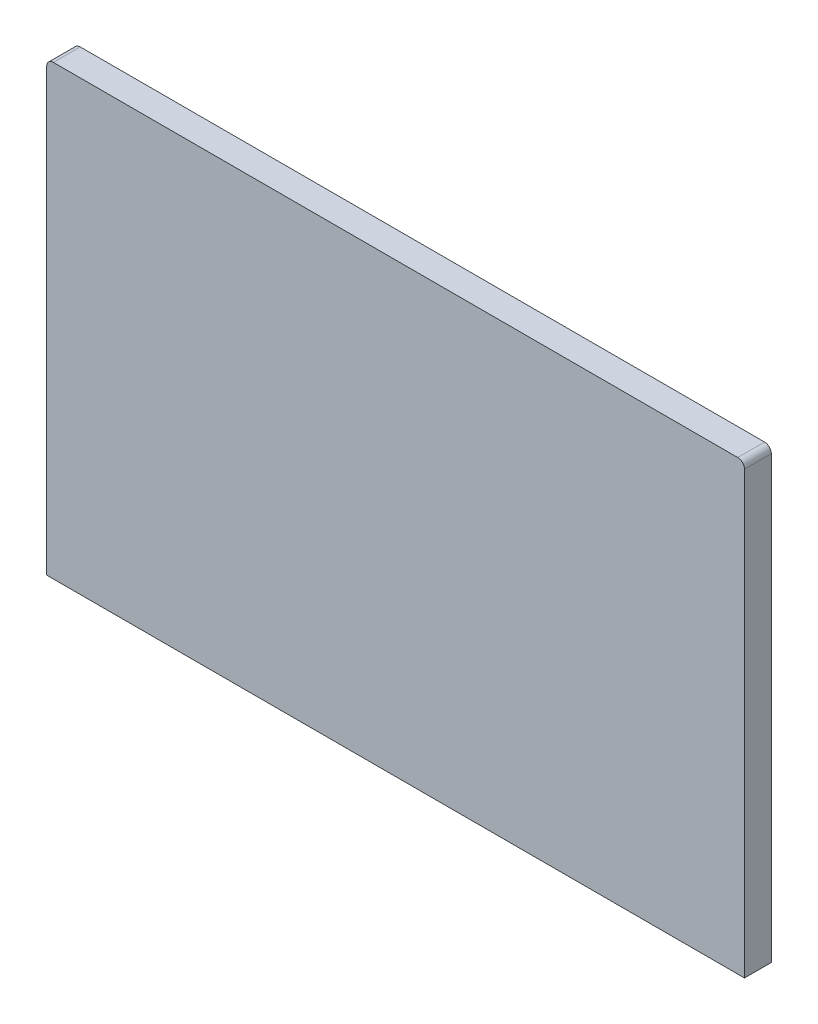
ISO-10303-21;
HEADER;
FILE_DESCRIPTION(('STEP AP214'),'2;1');
FILE_NAME('part.step','',(''),(''),'','','');
FILE_SCHEMA(('AUTOMOTIVE_DESIGN { 1 0 10303 214 1 1 1 1 }'));
ENDSEC;
DATA;
#1=APPLICATION_CONTEXT('core data for automotive mechanical design processes');
#2=APPLICATION_PROTOCOL_DEFINITION('international standard','automotive_design',2000,#1);
#3=PRODUCT_CONTEXT('',#1,'mechanical');
#4=PRODUCT('Part','Part','',(#3));
#5=PRODUCT_RELATED_PRODUCT_CATEGORY('part','',(#4));
#6=PRODUCT_DEFINITION_FORMATION('','',#4);
#7=PRODUCT_DEFINITION_CONTEXT('part definition',#1,'design');
#8=PRODUCT_DEFINITION('design','',#6,#7);
#9=PRODUCT_DEFINITION_SHAPE('','',#8);
#10=(LENGTH_UNIT() NAMED_UNIT(*) SI_UNIT(.MILLI.,.METRE.));
#11=(NAMED_UNIT(*) PLANE_ANGLE_UNIT() SI_UNIT($,.RADIAN.));
#12=(NAMED_UNIT(*) SI_UNIT($,.STERADIAN.) SOLID_ANGLE_UNIT());
#13=UNCERTAINTY_MEASURE_WITH_UNIT(LENGTH_MEASURE(1.E-05),#10,'distance_accuracy_value','');
#14=(GEOMETRIC_REPRESENTATION_CONTEXT(3) GLOBAL_UNCERTAINTY_ASSIGNED_CONTEXT((#13)) GLOBAL_UNIT_ASSIGNED_CONTEXT((#10,
#11,#12)) REPRESENTATION_CONTEXT('',''));
#15=CARTESIAN_POINT('',(0.,0.,0.));
#16=DIRECTION('',(0.,0.,1.));
#17=DIRECTION('',(1.,0.,0.));
#18=AXIS2_PLACEMENT_3D('',#15,#16,#17);
#19=CARTESIAN_POINT('',(25.5,17.571107205859,2.));
#20=DIRECTION('',(0.,0.,-1.));
#21=DIRECTION('',(-1.,0.,0.));
#22=AXIS2_PLACEMENT_3D('',#19,#20,#21);
#23=CYLINDRICAL_SURFACE('',#22,0.5);
#24=CARTESIAN_POINT('',(25.5,17.571107205859,0.));
#25=DIRECTION('',(0.,0.,1.));
#26=DIRECTION('',(1.,0.,0.));
#27=AXIS2_PLACEMENT_3D('',#24,#25,#26);
#28=CIRCLE('',#27,0.5);
#29=CARTESIAN_POINT('',(26.,17.571107205859,0.));
#30=VERTEX_POINT('',#29);
#31=CARTESIAN_POINT('',(25.5,18.071107205859,0.));
#32=VERTEX_POINT('',#31);
#33=EDGE_CURVE('E123',#30,#32,#28,.T.);
#34=ORIENTED_EDGE('',*,*,#33,.T.);
#35=DIRECTION('',(0.,0.,-1.));
#36=VECTOR('',#35,1.);
#37=CARTESIAN_POINT('',(25.5,18.071107205859,2.));
#38=LINE('',#37,#36);
#39=CARTESIAN_POINT('',(25.5,18.071107205859,2.));
#40=VERTEX_POINT('',#39);
#41=EDGE_CURVE('E11',#40,#32,#38,.T.);
#42=ORIENTED_EDGE('',*,*,#41,.F.);
#43=CARTESIAN_POINT('',(25.5,17.571107205859,2.));
#44=DIRECTION('',(0.,0.,1.));
#45=DIRECTION('',(1.,0.,0.));
#46=AXIS2_PLACEMENT_3D('',#43,#44,#45);
#47=CIRCLE('',#46,0.5);
#48=CARTESIAN_POINT('',(26.,17.571107205859,2.));
#49=VERTEX_POINT('',#48);
#50=EDGE_CURVE('E135',#49,#40,#47,.T.);
#51=ORIENTED_EDGE('',*,*,#50,.F.);
#52=DIRECTION('',(0.,0.,-1.));
#53=VECTOR('',#52,1.);
#54=CARTESIAN_POINT('',(26.,17.571107205859,2.));
#55=LINE('',#54,#53);
#56=EDGE_CURVE('E119',#49,#30,#55,.T.);
#57=ORIENTED_EDGE('',*,*,#56,.T.);
#58=EDGE_LOOP('',(#34,#42,#51,#57));
#59=FACE_BOUND('',#58,.T.);
#60=ADVANCED_FACE('F39',(#59),#23,.T.);
#61=CARTESIAN_POINT('',(-21.5,18.071107205859,2.));
#62=DIRECTION('',(0.,-1.,0.));
#63=DIRECTION('',(0.,0.,-1.));
#64=AXIS2_PLACEMENT_3D('',#61,#62,#63);
#65=PLANE('',#64);
#66=DIRECTION('',(-1.,0.,0.));
#67=VECTOR('',#66,1.);
#68=CARTESIAN_POINT('',(-21.5,18.071107205859,0.));
#69=LINE('',#68,#67);
#70=CARTESIAN_POINT('',(-25.5,18.071107205859,0.));
#71=VERTEX_POINT('',#70);
#72=EDGE_CURVE('E126',#32,#71,#69,.T.);
#73=ORIENTED_EDGE('',*,*,#72,.T.);
#74=DIRECTION('',(0.,0.,-1.));
#75=VECTOR('',#74,1.);
#76=CARTESIAN_POINT('',(-25.5,18.071107205859,2.));
#77=LINE('',#76,#75);
#78=CARTESIAN_POINT('',(-25.5,18.071107205859,2.));
#79=VERTEX_POINT('',#78);
#80=EDGE_CURVE('E47',#79,#71,#77,.T.);
#81=ORIENTED_EDGE('',*,*,#80,.F.);
#82=DIRECTION('',(-1.,0.,0.));
#83=VECTOR('',#82,1.);
#84=CARTESIAN_POINT('',(25.5,18.071107205859,2.));
#85=LINE('',#84,#83);
#86=EDGE_CURVE('E90',#40,#79,#85,.T.);
#87=ORIENTED_EDGE('',*,*,#86,.F.);
#88=ORIENTED_EDGE('',*,*,#41,.T.);
#89=EDGE_LOOP('',(#73,#81,#87,#88));
#90=FACE_BOUND('',#89,.T.);
#91=ADVANCED_FACE('F149',(#90),#65,.F.);
#92=CARTESIAN_POINT('',(-25.5,17.571107205859,2.));
#93=DIRECTION('',(0.,0.,-1.));
#94=DIRECTION('',(-1.,0.,0.));
#95=AXIS2_PLACEMENT_3D('',#92,#93,#94);
#96=CYLINDRICAL_SURFACE('',#95,0.5);
#97=CARTESIAN_POINT('',(-25.5,17.571107205859,0.));
#98=DIRECTION('',(0.,0.,1.));
#99=DIRECTION('',(1.,0.,0.));
#100=AXIS2_PLACEMENT_3D('',#97,#98,#99);
#101=CIRCLE('',#100,0.5);
#102=CARTESIAN_POINT('',(-26.,17.571107205859,0.));
#103=VERTEX_POINT('',#102);
#104=EDGE_CURVE('E128',#71,#103,#101,.T.);
#105=ORIENTED_EDGE('',*,*,#104,.T.);
#106=DIRECTION('',(0.,0.,-1.));
#107=VECTOR('',#106,1.);
#108=CARTESIAN_POINT('',(-26.,17.571107205859,2.));
#109=LINE('',#108,#107);
#110=CARTESIAN_POINT('',(-26.,17.571107205859,2.));
#111=VERTEX_POINT('',#110);
#112=EDGE_CURVE('E114',#111,#103,#109,.T.);
#113=ORIENTED_EDGE('',*,*,#112,.F.);
#114=CARTESIAN_POINT('',(-25.5,17.571107205859,2.));
#115=DIRECTION('',(0.,0.,1.));
#116=DIRECTION('',(1.,0.,0.));
#117=AXIS2_PLACEMENT_3D('',#114,#115,#116);
#118=CIRCLE('',#117,0.5);
#119=EDGE_CURVE('E104',#79,#111,#118,.T.);
#120=ORIENTED_EDGE('',*,*,#119,.F.);
#121=ORIENTED_EDGE('',*,*,#80,.T.);
#122=EDGE_LOOP('',(#105,#113,#120,#121));
#123=FACE_BOUND('',#122,.T.);
#124=ADVANCED_FACE('F141',(#123),#96,.T.);
#125=CARTESIAN_POINT('',(-26.,13.071107205859,2.));
#126=DIRECTION('',(1.,0.,0.));
#127=DIRECTION('',(0.,0.,-1.));
#128=AXIS2_PLACEMENT_3D('',#125,#126,#127);
#129=PLANE('',#128);
#130=DIRECTION('',(0.,-1.,0.));
#131=VECTOR('',#130,1.);
#132=CARTESIAN_POINT('',(-26.,13.071107205859,0.));
#133=LINE('',#132,#131);
#134=CARTESIAN_POINT('',(-26.,-15.2686187483682,0.));
#135=VERTEX_POINT('',#134);
#136=EDGE_CURVE('E112',#103,#135,#133,.T.);
#137=ORIENTED_EDGE('',*,*,#136,.T.);
#138=DIRECTION('',(0.,0.,-1.));
#139=VECTOR('',#138,1.);
#140=CARTESIAN_POINT('',(-26.,-15.2686187483682,2.));
#141=LINE('',#140,#139);
#142=CARTESIAN_POINT('',(-26.,-15.2686187483682,2.));
#143=VERTEX_POINT('',#142);
#144=EDGE_CURVE('E110',#143,#135,#141,.T.);
#145=ORIENTED_EDGE('',*,*,#144,.F.);
#146=DIRECTION('',(0.,-1.,0.));
#147=VECTOR('',#146,1.);
#148=CARTESIAN_POINT('',(-26.,17.571107205859,2.));
#149=LINE('',#148,#147);
#150=EDGE_CURVE('E97',#111,#143,#149,.T.);
#151=ORIENTED_EDGE('',*,*,#150,.F.);
#152=ORIENTED_EDGE('',*,*,#112,.T.);
#153=EDGE_LOOP('',(#137,#145,#151,#152));
#154=FACE_BOUND('',#153,.T.);
#155=ADVANCED_FACE('F111',(#154),#129,.F.);
#156=CARTESIAN_POINT('',(-26.,-15.2686187483682,2.));
#157=DIRECTION('',(0.,1.,0.));
#158=DIRECTION('',(-1.,0.,0.));
#159=AXIS2_PLACEMENT_3D('',#156,#157,#158);
#160=PLANE('',#159);
#161=DIRECTION('',(1.,0.,0.));
#162=VECTOR('',#161,1.);
#163=CARTESIAN_POINT('',(-26.,-15.2686187483682,0.));
#164=LINE('',#163,#162);
#165=CARTESIAN_POINT('',(26.,-15.2686187483682,0.));
#166=VERTEX_POINT('',#165);
#167=EDGE_CURVE('E132',#135,#166,#164,.T.);
#168=ORIENTED_EDGE('',*,*,#167,.T.);
#169=DIRECTION('',(0.,0.,-1.));
#170=VECTOR('',#169,1.);
#171=CARTESIAN_POINT('',(26.,-15.2686187483682,2.));
#172=LINE('',#171,#170);
#173=CARTESIAN_POINT('',(26.,-15.2686187483682,2.));
#174=VERTEX_POINT('',#173);
#175=EDGE_CURVE('E115',#174,#166,#172,.T.);
#176=ORIENTED_EDGE('',*,*,#175,.F.);
#177=DIRECTION('',(1.,0.,0.));
#178=VECTOR('',#177,1.);
#179=CARTESIAN_POINT('',(-26.,-15.2686187483682,2.));
#180=LINE('',#179,#178);
#181=EDGE_CURVE('E101',#143,#174,#180,.T.);
#182=ORIENTED_EDGE('',*,*,#181,.F.);
#183=ORIENTED_EDGE('',*,*,#144,.T.);
#184=EDGE_LOOP('',(#168,#176,#182,#183));
#185=FACE_BOUND('',#184,.T.);
#186=ADVANCED_FACE('F117',(#185),#160,.F.);
#187=CARTESIAN_POINT('',(26.,13.571107205859,2.));
#188=DIRECTION('',(-1.,0.,0.));
#189=DIRECTION('',(0.,0.,1.));
#190=AXIS2_PLACEMENT_3D('',#187,#188,#189);
#191=PLANE('',#190);
#192=DIRECTION('',(0.,1.,0.));
#193=VECTOR('',#192,1.);
#194=CARTESIAN_POINT('',(26.,13.571107205859,0.));
#195=LINE('',#194,#193);
#196=EDGE_CURVE('E78',#166,#30,#195,.T.);
#197=ORIENTED_EDGE('',*,*,#196,.T.);
#198=ORIENTED_EDGE('',*,*,#56,.F.);
#199=DIRECTION('',(0.,1.,0.));
#200=VECTOR('',#199,1.);
#201=CARTESIAN_POINT('',(26.,-15.2686187483682,2.));
#202=LINE('',#201,#200);
#203=EDGE_CURVE('E55',#174,#49,#202,.T.);
#204=ORIENTED_EDGE('',*,*,#203,.F.);
#205=ORIENTED_EDGE('',*,*,#175,.T.);
#206=EDGE_LOOP('',(#197,#198,#204,#205));
#207=FACE_BOUND('',#206,.T.);
#208=ADVANCED_FACE('F143',(#207),#191,.F.);
#209=CARTESIAN_POINT('',(25.5,17.571107205859,2.));
#210=DIRECTION('',(0.,0.,1.));
#211=DIRECTION('',(1.,0.,0.));
#212=AXIS2_PLACEMENT_3D('',#209,#210,#211);
#213=PLANE('',#212);
#214=ORIENTED_EDGE('',*,*,#50,.T.);
#215=ORIENTED_EDGE('',*,*,#86,.T.);
#216=ORIENTED_EDGE('',*,*,#119,.T.);
#217=ORIENTED_EDGE('',*,*,#150,.T.);
#218=ORIENTED_EDGE('',*,*,#181,.T.);
#219=ORIENTED_EDGE('',*,*,#203,.T.);
#220=EDGE_LOOP('',(#214,#215,#216,#217,#218,#219));
#221=FACE_BOUND('',#220,.T.);
#222=ADVANCED_FACE('F99',(#221),#213,.T.);
#223=CARTESIAN_POINT('',(25.5,17.571107205859,0.));
#224=DIRECTION('',(0.,0.,1.));
#225=DIRECTION('',(1.,0.,0.));
#226=AXIS2_PLACEMENT_3D('',#223,#224,#225);
#227=PLANE('',#226);
#228=ORIENTED_EDGE('',*,*,#33,.F.);
#229=ORIENTED_EDGE('',*,*,#196,.F.);
#230=ORIENTED_EDGE('',*,*,#167,.F.);
#231=ORIENTED_EDGE('',*,*,#136,.F.);
#232=ORIENTED_EDGE('',*,*,#104,.F.);
#233=ORIENTED_EDGE('',*,*,#72,.F.);
#234=EDGE_LOOP('',(#228,#229,#230,#231,#232,#233));
#235=FACE_BOUND('',#234,.T.);
#236=ADVANCED_FACE('F142',(#235),#227,.F.);
#237=CLOSED_SHELL('',(#60,#91,#124,#155,#186,#208,#222,#236));
#238=MANIFOLD_SOLID_BREP('B2',#237);
#239=ADVANCED_BREP_SHAPE_REPRESENTATION('',(#18,#238),#14);
#240=SHAPE_DEFINITION_REPRESENTATION(#9,#239);
ENDSEC;
END-ISO-10303-21;
